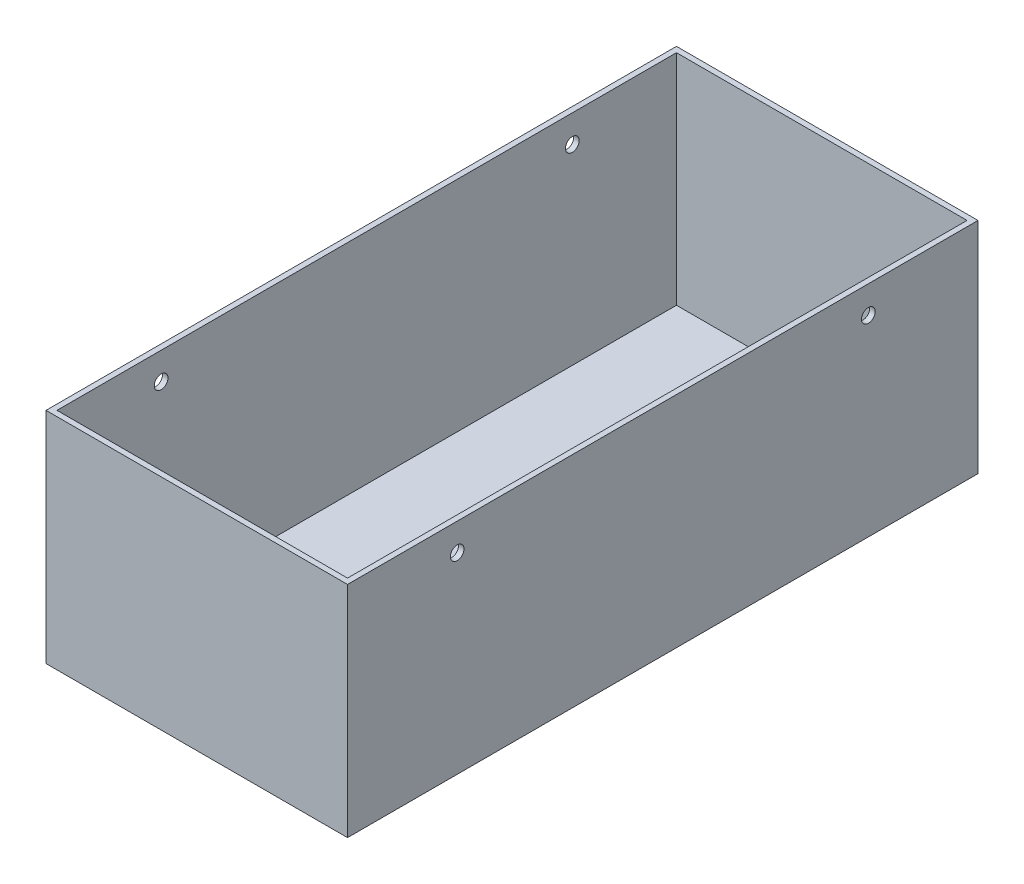
ISO-10303-21;
HEADER;
FILE_DESCRIPTION(('STEP AP214'),'2;1');
FILE_NAME('part.step','',(''),(''),'','','');
FILE_SCHEMA(('AUTOMOTIVE_DESIGN { 1 0 10303 214 1 1 1 1 }'));
ENDSEC;
DATA;
#1=APPLICATION_CONTEXT('core data for automotive mechanical design processes');
#2=APPLICATION_PROTOCOL_DEFINITION('international standard','automotive_design',2000,#1);
#3=PRODUCT_CONTEXT('',#1,'mechanical');
#4=PRODUCT('Part','Part','',(#3));
#5=PRODUCT_RELATED_PRODUCT_CATEGORY('part','',(#4));
#6=PRODUCT_DEFINITION_FORMATION('','',#4);
#7=PRODUCT_DEFINITION_CONTEXT('part definition',#1,'design');
#8=PRODUCT_DEFINITION('design','',#6,#7);
#9=PRODUCT_DEFINITION_SHAPE('','',#8);
#10=(LENGTH_UNIT() NAMED_UNIT(*) SI_UNIT(.MILLI.,.METRE.));
#11=(NAMED_UNIT(*) PLANE_ANGLE_UNIT() SI_UNIT($,.RADIAN.));
#12=(NAMED_UNIT(*) SI_UNIT($,.STERADIAN.) SOLID_ANGLE_UNIT());
#13=UNCERTAINTY_MEASURE_WITH_UNIT(LENGTH_MEASURE(1.E-05),#10,'distance_accuracy_value','');
#14=(GEOMETRIC_REPRESENTATION_CONTEXT(3) GLOBAL_UNCERTAINTY_ASSIGNED_CONTEXT((#13)) GLOBAL_UNIT_ASSIGNED_CONTEXT((#10,
#11,#12)) REPRESENTATION_CONTEXT('',''));
#15=CARTESIAN_POINT('',(0.,0.,0.));
#16=DIRECTION('',(0.,0.,1.));
#17=DIRECTION('',(1.,0.,0.));
#18=AXIS2_PLACEMENT_3D('',#15,#16,#17);
#19=CARTESIAN_POINT('',(62.5995229003825,80.,-198.466658240479));
#20=DIRECTION('',(1.,0.,0.));
#21=DIRECTION('',(0.,0.,-1.));
#22=AXIS2_PLACEMENT_3D('',#19,#20,#21);
#23=PLANE('',#22);
#24=CARTESIAN_POINT('',(62.5995229003825,70.,-8.46665824047898));
#25=DIRECTION('',(-1.,0.,0.));
#26=DIRECTION('',(0.,0.,1.));
#27=AXIS2_PLACEMENT_3D('',#24,#25,#26);
#28=CIRCLE('',#27,2.5);
#29=CARTESIAN_POINT('',(62.5995229003825,70.,-5.96665824047898));
#30=VERTEX_POINT('',#29);
#31=EDGE_CURVE('E177',#30,#30,#28,.T.);
#32=ORIENTED_EDGE('',*,*,#31,.F.);
#33=EDGE_LOOP('',(#32));
#34=FACE_BOUND('',#33,.T.);
#35=DIRECTION('',(0.,0.,1.));
#36=VECTOR('',#35,1.);
#37=CARTESIAN_POINT('',(62.5995229003825,0.,-198.466658240479));
#38=LINE('',#37,#36);
#39=CARTESIAN_POINT('',(62.5995229003825,0.,-198.466658240479));
#40=VERTEX_POINT('',#39);
#41=CARTESIAN_POINT('',(62.5995229003825,0.,31.533341759521));
#42=VERTEX_POINT('',#41);
#43=EDGE_CURVE('E145',#40,#42,#38,.T.);
#44=ORIENTED_EDGE('',*,*,#43,.T.);
#45=DIRECTION('',(0.,-1.,0.));
#46=VECTOR('',#45,1.);
#47=CARTESIAN_POINT('',(62.5995229003825,80.,31.533341759521));
#48=LINE('',#47,#46);
#49=CARTESIAN_POINT('',(62.5995229003825,80.,31.533341759521));
#50=VERTEX_POINT('',#49);
#51=EDGE_CURVE('E11',#50,#42,#48,.T.);
#52=ORIENTED_EDGE('',*,*,#51,.F.);
#53=DIRECTION('',(0.,0.,1.));
#54=VECTOR('',#53,1.);
#55=CARTESIAN_POINT('',(62.5995229003825,80.,-198.466658240479));
#56=LINE('',#55,#54);
#57=CARTESIAN_POINT('',(62.5995229003825,80.,-198.466658240479));
#58=VERTEX_POINT('',#57);
#59=EDGE_CURVE('E149',#58,#50,#56,.T.);
#60=ORIENTED_EDGE('',*,*,#59,.F.);
#61=DIRECTION('',(0.,-1.,0.));
#62=VECTOR('',#61,1.);
#63=CARTESIAN_POINT('',(62.5995229003825,80.,-198.466658240479));
#64=LINE('',#63,#62);
#65=EDGE_CURVE('E155',#58,#40,#64,.T.);
#66=ORIENTED_EDGE('',*,*,#65,.T.);
#67=EDGE_LOOP('',(#44,#52,#60,#66));
#68=FACE_BOUND('',#67,.T.);
#69=CARTESIAN_POINT('',(62.5995229003825,70.,-158.466658240479));
#70=DIRECTION('',(-1.,0.,0.));
#71=DIRECTION('',(0.,0.,1.));
#72=AXIS2_PLACEMENT_3D('',#69,#70,#71);
#73=CIRCLE('',#72,2.49999999999997);
#74=CARTESIAN_POINT('',(62.5995229003825,70.,-155.966658240479));
#75=VERTEX_POINT('',#74);
#76=EDGE_CURVE('E170',#75,#75,#73,.F.);
#77=ORIENTED_EDGE('',*,*,#76,.T.);
#78=EDGE_LOOP('',(#77));
#79=FACE_BOUND('',#78,.T.);
#80=ADVANCED_FACE('F32',(#34,#68,#79),#23,.F.);
#81=CARTESIAN_POINT('',(172.599522900382,80.,-198.466658240479));
#82=DIRECTION('',(-1.,0.,0.));
#83=DIRECTION('',(0.,0.,1.));
#84=AXIS2_PLACEMENT_3D('',#81,#82,#83);
#85=PLANE('',#84);
#86=CARTESIAN_POINT('',(172.599522900383,70.,-8.46665824047898));
#87=DIRECTION('',(-1.,0.,0.));
#88=DIRECTION('',(0.,0.,1.));
#89=AXIS2_PLACEMENT_3D('',#86,#87,#88);
#90=CIRCLE('',#89,2.5);
#91=CARTESIAN_POINT('',(172.599522900383,70.,-5.96665824047898));
#92=VERTEX_POINT('',#91);
#93=EDGE_CURVE('E174',#92,#92,#90,.T.);
#94=ORIENTED_EDGE('',*,*,#93,.T.);
#95=EDGE_LOOP('',(#94));
#96=FACE_BOUND('',#95,.T.);
#97=DIRECTION('',(0.,0.,-1.));
#98=VECTOR('',#97,1.);
#99=CARTESIAN_POINT('',(172.599522900382,0.,-198.466658240479));
#100=LINE('',#99,#98);
#101=CARTESIAN_POINT('',(172.599522900383,0.,31.533341759521));
#102=VERTEX_POINT('',#101);
#103=CARTESIAN_POINT('',(172.599522900382,0.,-198.466658240479));
#104=VERTEX_POINT('',#103);
#105=EDGE_CURVE('E160',#102,#104,#100,.T.);
#106=ORIENTED_EDGE('',*,*,#105,.T.);
#107=DIRECTION('',(0.,-1.,0.));
#108=VECTOR('',#107,1.);
#109=CARTESIAN_POINT('',(172.599522900382,80.,-198.466658240479));
#110=LINE('',#109,#108);
#111=CARTESIAN_POINT('',(172.599522900382,80.,-198.466658240479));
#112=VERTEX_POINT('',#111);
#113=EDGE_CURVE('E164',#112,#104,#110,.T.);
#114=ORIENTED_EDGE('',*,*,#113,.F.);
#115=DIRECTION('',(0.,0.,-1.));
#116=VECTOR('',#115,1.);
#117=CARTESIAN_POINT('',(172.599522900382,80.,-198.466658240479));
#118=LINE('',#117,#116);
#119=CARTESIAN_POINT('',(172.599522900383,80.,31.533341759521));
#120=VERTEX_POINT('',#119);
#121=EDGE_CURVE('E152',#120,#112,#118,.T.);
#122=ORIENTED_EDGE('',*,*,#121,.F.);
#123=DIRECTION('',(0.,-1.,0.));
#124=VECTOR('',#123,1.);
#125=CARTESIAN_POINT('',(172.599522900383,80.,31.533341759521));
#126=LINE('',#125,#124);
#127=EDGE_CURVE('E40',#120,#102,#126,.T.);
#128=ORIENTED_EDGE('',*,*,#127,.T.);
#129=EDGE_LOOP('',(#106,#114,#122,#128));
#130=FACE_BOUND('',#129,.T.);
#131=CARTESIAN_POINT('',(172.599522900382,70.,-158.466658240479));
#132=DIRECTION('',(-1.,0.,0.));
#133=DIRECTION('',(0.,0.,1.));
#134=AXIS2_PLACEMENT_3D('',#131,#132,#133);
#135=CIRCLE('',#134,2.49999999999997);
#136=CARTESIAN_POINT('',(172.599522900382,70.,-155.966658240479));
#137=VERTEX_POINT('',#136);
#138=EDGE_CURVE('E133',#137,#137,#135,.F.);
#139=ORIENTED_EDGE('',*,*,#138,.F.);
#140=EDGE_LOOP('',(#139));
#141=FACE_BOUND('',#140,.T.);
#142=ADVANCED_FACE('F205',(#96,#130,#141),#85,.F.);
#143=CARTESIAN_POINT('',(64.5995229003825,0.200000000000006,0.));
#144=DIRECTION('',(-1.,0.,0.));
#145=DIRECTION('',(0.,0.,1.));
#146=AXIS2_PLACEMENT_3D('',#143,#144,#145);
#147=PLANE('',#146);
#148=CARTESIAN_POINT('',(64.5995229003825,70.,-8.46665824047898));
#149=DIRECTION('',(-1.,0.,0.));
#150=DIRECTION('',(0.,0.,1.));
#151=AXIS2_PLACEMENT_3D('',#148,#149,#150);
#152=CIRCLE('',#151,2.5);
#153=CARTESIAN_POINT('',(64.5995229003825,70.,-5.96665824047898));
#154=VERTEX_POINT('',#153);
#155=EDGE_CURVE('E169',#154,#154,#152,.T.);
#156=ORIENTED_EDGE('',*,*,#155,.T.);
#157=EDGE_LOOP('',(#156));
#158=FACE_BOUND('',#157,.T.);
#159=DIRECTION('',(0.,0.,1.));
#160=VECTOR('',#159,1.);
#161=CARTESIAN_POINT('',(64.5995229003825,80.,0.));
#162=LINE('',#161,#160);
#163=CARTESIAN_POINT('',(64.5995229003825,80.,-196.466658240479));
#164=VERTEX_POINT('',#163);
#165=CARTESIAN_POINT('',(64.5995229003825,80.,29.533341759521));
#166=VERTEX_POINT('',#165);
#167=EDGE_CURVE('E48',#164,#166,#162,.T.);
#168=ORIENTED_EDGE('',*,*,#167,.T.);
#169=DIRECTION('',(0.,1.,0.));
#170=VECTOR('',#169,1.);
#171=CARTESIAN_POINT('',(64.5995229003825,0.200000000000006,29.533341759521));
#172=LINE('',#171,#170);
#173=CARTESIAN_POINT('',(64.5995229003825,0.200000000000006,29.533341759521));
#174=VERTEX_POINT('',#173);
#175=EDGE_CURVE('E105',#174,#166,#172,.T.);
#176=ORIENTED_EDGE('',*,*,#175,.F.);
#177=DIRECTION('',(0.,0.,1.));
#178=VECTOR('',#177,1.);
#179=CARTESIAN_POINT('',(64.5995229003825,0.200000000000006,0.));
#180=LINE('',#179,#178);
#181=CARTESIAN_POINT('',(64.5995229003825,0.200000000000006,-196.466658240479));
#182=VERTEX_POINT('',#181);
#183=EDGE_CURVE('E110',#182,#174,#180,.T.);
#184=ORIENTED_EDGE('',*,*,#183,.F.);
#185=DIRECTION('',(0.,1.,0.));
#186=VECTOR('',#185,1.);
#187=CARTESIAN_POINT('',(64.5995229003825,0.200000000000006,-196.466658240479));
#188=LINE('',#187,#186);
#189=EDGE_CURVE('E143',#182,#164,#188,.T.);
#190=ORIENTED_EDGE('',*,*,#189,.T.);
#191=EDGE_LOOP('',(#168,#176,#184,#190));
#192=FACE_BOUND('',#191,.T.);
#193=CARTESIAN_POINT('',(64.5995229003825,70.,-158.466658240479));
#194=DIRECTION('',(-1.,0.,0.));
#195=DIRECTION('',(0.,0.,1.));
#196=AXIS2_PLACEMENT_3D('',#193,#194,#195);
#197=CIRCLE('',#196,2.49999999999997);
#198=CARTESIAN_POINT('',(64.5995229003825,70.,-155.966658240479));
#199=VERTEX_POINT('',#198);
#200=EDGE_CURVE('E185',#199,#199,#197,.F.);
#201=ORIENTED_EDGE('',*,*,#200,.F.);
#202=EDGE_LOOP('',(#201));
#203=FACE_BOUND('',#202,.T.);
#204=ADVANCED_FACE('F107',(#158,#192,#203),#147,.F.);
#205=CARTESIAN_POINT('',(170.599522900382,0.200000000000006,0.));
#206=DIRECTION('',(1.,0.,0.));
#207=DIRECTION('',(0.,0.,-1.));
#208=AXIS2_PLACEMENT_3D('',#205,#206,#207);
#209=PLANE('',#208);
#210=CARTESIAN_POINT('',(170.599522900382,70.,-8.46665824047898));
#211=DIRECTION('',(1.,0.,0.));
#212=DIRECTION('',(0.,0.,-1.));
#213=AXIS2_PLACEMENT_3D('',#210,#211,#212);
#214=CIRCLE('',#213,2.5);
#215=CARTESIAN_POINT('',(170.599522900382,70.,-10.966658240479));
#216=VERTEX_POINT('',#215);
#217=EDGE_CURVE('E167',#216,#216,#214,.T.);
#218=ORIENTED_EDGE('',*,*,#217,.T.);
#219=EDGE_LOOP('',(#218));
#220=FACE_BOUND('',#219,.T.);
#221=DIRECTION('',(0.,0.,-1.));
#222=VECTOR('',#221,1.);
#223=CARTESIAN_POINT('',(170.599522900382,80.,0.));
#224=LINE('',#223,#222);
#225=CARTESIAN_POINT('',(170.599522900382,80.,29.533341759521));
#226=VERTEX_POINT('',#225);
#227=CARTESIAN_POINT('',(170.599522900382,80.,-196.466658240479));
#228=VERTEX_POINT('',#227);
#229=EDGE_CURVE('E130',#226,#228,#224,.T.);
#230=ORIENTED_EDGE('',*,*,#229,.T.);
#231=DIRECTION('',(0.,1.,0.));
#232=VECTOR('',#231,1.);
#233=CARTESIAN_POINT('',(170.599522900382,0.200000000000006,-196.466658240479));
#234=LINE('',#233,#232);
#235=CARTESIAN_POINT('',(170.599522900382,0.200000000000006,-196.466658240479));
#236=VERTEX_POINT('',#235);
#237=EDGE_CURVE('E146',#236,#228,#234,.T.);
#238=ORIENTED_EDGE('',*,*,#237,.F.);
#239=DIRECTION('',(0.,0.,-1.));
#240=VECTOR('',#239,1.);
#241=CARTESIAN_POINT('',(170.599522900382,0.200000000000006,0.));
#242=LINE('',#241,#240);
#243=CARTESIAN_POINT('',(170.599522900382,0.200000000000006,29.533341759521));
#244=VERTEX_POINT('',#243);
#245=EDGE_CURVE('E123',#244,#236,#242,.T.);
#246=ORIENTED_EDGE('',*,*,#245,.F.);
#247=DIRECTION('',(0.,1.,0.));
#248=VECTOR('',#247,1.);
#249=CARTESIAN_POINT('',(170.599522900382,0.200000000000006,29.533341759521));
#250=LINE('',#249,#248);
#251=EDGE_CURVE('E114',#244,#226,#250,.T.);
#252=ORIENTED_EDGE('',*,*,#251,.T.);
#253=EDGE_LOOP('',(#230,#238,#246,#252));
#254=FACE_BOUND('',#253,.T.);
#255=CARTESIAN_POINT('',(170.599522900382,70.,-158.466658240479));
#256=DIRECTION('',(1.,0.,0.));
#257=DIRECTION('',(0.,0.,-1.));
#258=AXIS2_PLACEMENT_3D('',#255,#256,#257);
#259=CIRCLE('',#258,2.49999999999997);
#260=CARTESIAN_POINT('',(170.599522900382,70.,-160.966658240479));
#261=VERTEX_POINT('',#260);
#262=EDGE_CURVE('E35',#261,#261,#259,.F.);
#263=ORIENTED_EDGE('',*,*,#262,.F.);
#264=EDGE_LOOP('',(#263));
#265=FACE_BOUND('',#264,.T.);
#266=ADVANCED_FACE('F196',(#220,#254,#265),#209,.F.);
#267=CARTESIAN_POINT('',(62.5995229003825,80.,31.533341759521));
#268=DIRECTION('',(0.,0.,-1.));
#269=DIRECTION('',(-1.,0.,0.));
#270=AXIS2_PLACEMENT_3D('',#267,#268,#269);
#271=PLANE('',#270);
#272=DIRECTION('',(1.,0.,0.));
#273=VECTOR('',#272,1.);
#274=CARTESIAN_POINT('',(62.5995229003825,0.,31.533341759521));
#275=LINE('',#274,#273);
#276=EDGE_CURVE('E158',#42,#102,#275,.T.);
#277=ORIENTED_EDGE('',*,*,#276,.T.);
#278=ORIENTED_EDGE('',*,*,#127,.F.);
#279=DIRECTION('',(1.,0.,0.));
#280=VECTOR('',#279,1.);
#281=CARTESIAN_POINT('',(62.5995229003825,80.,31.533341759521));
#282=LINE('',#281,#280);
#283=EDGE_CURVE('E85',#50,#120,#282,.T.);
#284=ORIENTED_EDGE('',*,*,#283,.F.);
#285=ORIENTED_EDGE('',*,*,#51,.T.);
#286=EDGE_LOOP('',(#277,#278,#284,#285));
#287=FACE_BOUND('',#286,.T.);
#288=ADVANCED_FACE('F198',(#287),#271,.F.);
#289=CARTESIAN_POINT('',(62.5995229003825,80.,-198.466658240479));
#290=DIRECTION('',(0.,0.,1.));
#291=DIRECTION('',(1.,0.,0.));
#292=AXIS2_PLACEMENT_3D('',#289,#290,#291);
#293=PLANE('',#292);
#294=DIRECTION('',(-1.,0.,0.));
#295=VECTOR('',#294,1.);
#296=CARTESIAN_POINT('',(62.5995229003825,0.,-198.466658240479));
#297=LINE('',#296,#295);
#298=EDGE_CURVE('E78',#104,#40,#297,.T.);
#299=ORIENTED_EDGE('',*,*,#298,.T.);
#300=ORIENTED_EDGE('',*,*,#65,.F.);
#301=DIRECTION('',(-1.,0.,0.));
#302=VECTOR('',#301,1.);
#303=CARTESIAN_POINT('',(62.5995229003825,80.,-198.466658240479));
#304=LINE('',#303,#302);
#305=EDGE_CURVE('E57',#112,#58,#304,.T.);
#306=ORIENTED_EDGE('',*,*,#305,.F.);
#307=ORIENTED_EDGE('',*,*,#113,.T.);
#308=EDGE_LOOP('',(#299,#300,#306,#307));
#309=FACE_BOUND('',#308,.T.);
#310=ADVANCED_FACE('F204',(#309),#293,.F.);
#311=CARTESIAN_POINT('',(0.,80.,0.));
#312=DIRECTION('',(0.,1.,0.));
#313=DIRECTION('',(0.,0.,1.));
#314=AXIS2_PLACEMENT_3D('',#311,#312,#313);
#315=PLANE('',#314);
#316=ORIENTED_EDGE('',*,*,#167,.F.);
#317=DIRECTION('',(1.,0.,0.));
#318=VECTOR('',#317,1.);
#319=CARTESIAN_POINT('',(0.,80.,-196.466658240479));
#320=LINE('',#319,#318);
#321=EDGE_CURVE('E127',#164,#228,#320,.T.);
#322=ORIENTED_EDGE('',*,*,#321,.T.);
#323=ORIENTED_EDGE('',*,*,#229,.F.);
#324=DIRECTION('',(1.,0.,0.));
#325=VECTOR('',#324,1.);
#326=CARTESIAN_POINT('',(0.,80.,29.533341759521));
#327=LINE('',#326,#325);
#328=EDGE_CURVE('E139',#166,#226,#327,.T.);
#329=ORIENTED_EDGE('',*,*,#328,.F.);
#330=EDGE_LOOP('',(#316,#322,#323,#329));
#331=FACE_BOUND('',#330,.T.);
#332=ORIENTED_EDGE('',*,*,#59,.T.);
#333=ORIENTED_EDGE('',*,*,#283,.T.);
#334=ORIENTED_EDGE('',*,*,#121,.T.);
#335=ORIENTED_EDGE('',*,*,#305,.T.);
#336=EDGE_LOOP('',(#332,#333,#334,#335));
#337=FACE_BOUND('',#336,.T.);
#338=ADVANCED_FACE('F230',(#331,#337),#315,.T.);
#339=CARTESIAN_POINT('',(0.,0.,0.));
#340=DIRECTION('',(0.,1.,0.));
#341=DIRECTION('',(0.,0.,1.));
#342=AXIS2_PLACEMENT_3D('',#339,#340,#341);
#343=PLANE('',#342);
#344=ORIENTED_EDGE('',*,*,#43,.F.);
#345=ORIENTED_EDGE('',*,*,#298,.F.);
#346=ORIENTED_EDGE('',*,*,#105,.F.);
#347=ORIENTED_EDGE('',*,*,#276,.F.);
#348=EDGE_LOOP('',(#344,#345,#346,#347));
#349=FACE_BOUND('',#348,.T.);
#350=ADVANCED_FACE('F224',(#349),#343,.F.);
#351=CARTESIAN_POINT('',(0.,0.200000000000006,-196.466658240479));
#352=DIRECTION('',(0.,0.,1.));
#353=DIRECTION('',(1.,0.,0.));
#354=AXIS2_PLACEMENT_3D('',#351,#352,#353);
#355=PLANE('',#354);
#356=ORIENTED_EDGE('',*,*,#321,.F.);
#357=ORIENTED_EDGE('',*,*,#189,.F.);
#358=DIRECTION('',(1.,0.,0.));
#359=VECTOR('',#358,1.);
#360=CARTESIAN_POINT('',(0.,0.200000000000006,-196.466658240479));
#361=LINE('',#360,#359);
#362=EDGE_CURVE('E115',#182,#236,#361,.T.);
#363=ORIENTED_EDGE('',*,*,#362,.T.);
#364=ORIENTED_EDGE('',*,*,#237,.T.);
#365=EDGE_LOOP('',(#356,#357,#363,#364));
#366=FACE_BOUND('',#365,.T.);
#367=ADVANCED_FACE('F238',(#366),#355,.T.);
#368=CARTESIAN_POINT('',(0.,0.200000000000006,29.533341759521));
#369=DIRECTION('',(0.,0.,1.));
#370=DIRECTION('',(1.,0.,0.));
#371=AXIS2_PLACEMENT_3D('',#368,#369,#370);
#372=PLANE('',#371);
#373=ORIENTED_EDGE('',*,*,#328,.T.);
#374=ORIENTED_EDGE('',*,*,#251,.F.);
#375=DIRECTION('',(1.,0.,0.));
#376=VECTOR('',#375,1.);
#377=CARTESIAN_POINT('',(0.,0.200000000000006,29.533341759521));
#378=LINE('',#377,#376);
#379=EDGE_CURVE('E118',#174,#244,#378,.T.);
#380=ORIENTED_EDGE('',*,*,#379,.F.);
#381=ORIENTED_EDGE('',*,*,#175,.T.);
#382=EDGE_LOOP('',(#373,#374,#380,#381));
#383=FACE_BOUND('',#382,.T.);
#384=ADVANCED_FACE('F119',(#383),#372,.F.);
#385=CARTESIAN_POINT('',(0.,0.200000000000006,0.));
#386=DIRECTION('',(0.,1.,0.));
#387=DIRECTION('',(0.,0.,1.));
#388=AXIS2_PLACEMENT_3D('',#385,#386,#387);
#389=PLANE('',#388);
#390=ORIENTED_EDGE('',*,*,#183,.T.);
#391=ORIENTED_EDGE('',*,*,#379,.T.);
#392=ORIENTED_EDGE('',*,*,#245,.T.);
#393=ORIENTED_EDGE('',*,*,#362,.F.);
#394=EDGE_LOOP('',(#390,#391,#392,#393));
#395=FACE_BOUND('',#394,.T.);
#396=ADVANCED_FACE('F126',(#395),#389,.T.);
#397=CARTESIAN_POINT('',(192.599522900383,70.,-8.46665824047898));
#398=DIRECTION('',(-1.,0.,0.));
#399=DIRECTION('',(0.,0.,1.));
#400=AXIS2_PLACEMENT_3D('',#397,#398,#399);
#401=CYLINDRICAL_SURFACE('',#400,2.5);
#402=ORIENTED_EDGE('',*,*,#217,.F.);
#403=EDGE_LOOP('',(#402));
#404=FACE_BOUND('',#403,.T.);
#405=ORIENTED_EDGE('',*,*,#93,.F.);
#406=EDGE_LOOP('',(#405));
#407=FACE_BOUND('',#406,.T.);
#408=ADVANCED_FACE('F246',(#404,#407),#401,.F.);
#409=CARTESIAN_POINT('',(192.599522900383,70.,-158.466658240479));
#410=DIRECTION('',(-1.,0.,0.));
#411=DIRECTION('',(0.,0.,1.));
#412=AXIS2_PLACEMENT_3D('',#409,#410,#411);
#413=CYLINDRICAL_SURFACE('',#412,2.49999999999997);
#414=ORIENTED_EDGE('',*,*,#262,.T.);
#415=EDGE_LOOP('',(#414));
#416=FACE_BOUND('',#415,.T.);
#417=ORIENTED_EDGE('',*,*,#138,.T.);
#418=EDGE_LOOP('',(#417));
#419=FACE_BOUND('',#418,.T.);
#420=ADVANCED_FACE('F193',(#416,#419),#413,.F.);
#421=ORIENTED_EDGE('',*,*,#31,.T.);
#422=EDGE_LOOP('',(#421));
#423=FACE_BOUND('',#422,.T.);
#424=ORIENTED_EDGE('',*,*,#155,.F.);
#425=EDGE_LOOP('',(#424));
#426=FACE_BOUND('',#425,.T.);
#427=ADVANCED_FACE('F256',(#423,#426),#401,.F.);
#428=ORIENTED_EDGE('',*,*,#76,.F.);
#429=EDGE_LOOP('',(#428));
#430=FACE_BOUND('',#429,.T.);
#431=ORIENTED_EDGE('',*,*,#200,.T.);
#432=EDGE_LOOP('',(#431));
#433=FACE_BOUND('',#432,.T.);
#434=ADVANCED_FACE('F258',(#430,#433),#413,.F.);
#435=CLOSED_SHELL('',(#80,#142,#204,#266,#288,#310,#338,#350,#367,#384,#396,#408,#420,#427,#434));
#436=MANIFOLD_SOLID_BREP('B2',#435);
#437=ADVANCED_BREP_SHAPE_REPRESENTATION('',(#18,#436),#14);
#438=SHAPE_DEFINITION_REPRESENTATION(#9,#437);
ENDSEC;
END-ISO-10303-21;
